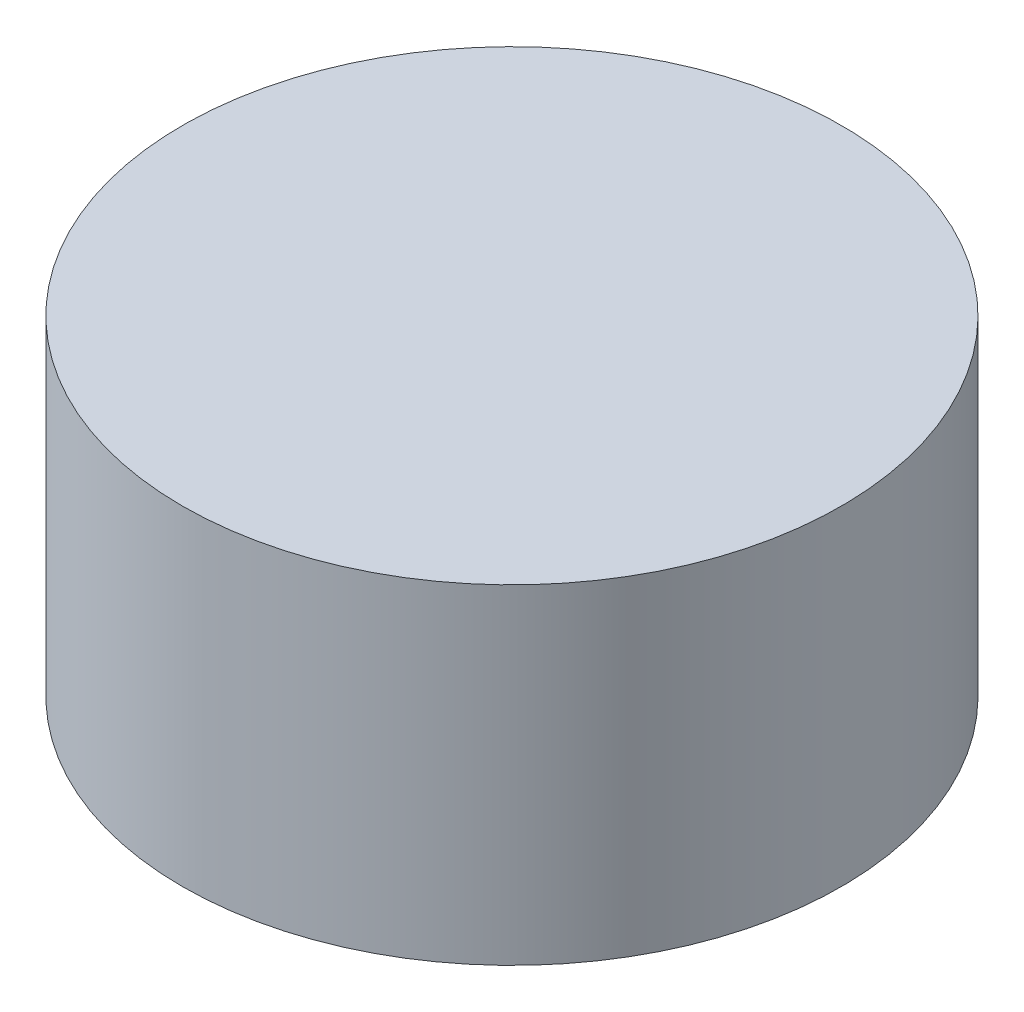
ISO-10303-21;
HEADER;
FILE_DESCRIPTION(('STEP AP214'),'2;1');
FILE_NAME('part.step','',(''),(''),'','','');
FILE_SCHEMA(('AUTOMOTIVE_DESIGN { 1 0 10303 214 1 1 1 1 }'));
ENDSEC;
DATA;
#1=APPLICATION_CONTEXT('core data for automotive mechanical design processes');
#2=APPLICATION_PROTOCOL_DEFINITION('international standard','automotive_design',2000,#1);
#3=PRODUCT_CONTEXT('',#1,'mechanical');
#4=PRODUCT('Part','Part','',(#3));
#5=PRODUCT_RELATED_PRODUCT_CATEGORY('part','',(#4));
#6=PRODUCT_DEFINITION_FORMATION('','',#4);
#7=PRODUCT_DEFINITION_CONTEXT('part definition',#1,'design');
#8=PRODUCT_DEFINITION('design','',#6,#7);
#9=PRODUCT_DEFINITION_SHAPE('','',#8);
#10=(LENGTH_UNIT() NAMED_UNIT(*) SI_UNIT(.MILLI.,.METRE.));
#11=(NAMED_UNIT(*) PLANE_ANGLE_UNIT() SI_UNIT($,.RADIAN.));
#12=(NAMED_UNIT(*) SI_UNIT($,.STERADIAN.) SOLID_ANGLE_UNIT());
#13=UNCERTAINTY_MEASURE_WITH_UNIT(LENGTH_MEASURE(1.E-05),#10,'distance_accuracy_value','');
#14=(GEOMETRIC_REPRESENTATION_CONTEXT(3) GLOBAL_UNCERTAINTY_ASSIGNED_CONTEXT((#13)) GLOBAL_UNIT_ASSIGNED_CONTEXT((#10,
#11,#12)) REPRESENTATION_CONTEXT('',''));
#15=CARTESIAN_POINT('',(0.,0.,0.));
#16=DIRECTION('',(0.,0.,1.));
#17=DIRECTION('',(1.,0.,0.));
#18=AXIS2_PLACEMENT_3D('',#15,#16,#17);
#19=CARTESIAN_POINT('',(0.,0.,0.));
#20=DIRECTION('',(0.,1.,0.));
#21=DIRECTION('',(0.,0.,1.));
#22=AXIS2_PLACEMENT_3D('',#19,#20,#21);
#23=PLANE('',#22);
#24=CARTESIAN_POINT('',(0.,0.,0.));
#25=DIRECTION('',(0.,1.,0.));
#26=DIRECTION('',(0.,0.,1.));
#27=AXIS2_PLACEMENT_3D('',#24,#25,#26);
#28=CIRCLE('',#27,6.);
#29=CARTESIAN_POINT('',(0.,0.,6.));
#30=VERTEX_POINT('',#29);
#31=EDGE_CURVE('E11',#30,#30,#28,.T.);
#32=ORIENTED_EDGE('',*,*,#31,.F.);
#33=EDGE_LOOP('',(#32));
#34=FACE_BOUND('',#33,.T.);
#35=CARTESIAN_POINT('',(0.,0.,0.));
#36=DIRECTION('',(0.,1.,0.));
#37=DIRECTION('',(0.,0.,1.));
#38=AXIS2_PLACEMENT_3D('',#35,#36,#37);
#39=CIRCLE('',#38,3.);
#40=CARTESIAN_POINT('',(0.,0.,3.));
#41=VERTEX_POINT('',#40);
#42=EDGE_CURVE('E44',#41,#41,#39,.T.);
#43=ORIENTED_EDGE('',*,*,#42,.T.);
#44=EDGE_LOOP('',(#43));
#45=FACE_BOUND('',#44,.T.);
#46=ADVANCED_FACE('F37',(#34,#45),#23,.F.);
#47=CARTESIAN_POINT('',(0.,3.,0.));
#48=DIRECTION('',(0.,-1.,0.));
#49=DIRECTION('',(0.,0.,-1.));
#50=AXIS2_PLACEMENT_3D('',#47,#48,#49);
#51=CYLINDRICAL_SURFACE('',#50,6.);
#52=ORIENTED_EDGE('',*,*,#31,.T.);
#53=EDGE_LOOP('',(#52));
#54=FACE_BOUND('',#53,.T.);
#55=CARTESIAN_POINT('',(0.,6.,0.));
#56=DIRECTION('',(0.,1.,0.));
#57=DIRECTION('',(0.,0.,1.));
#58=AXIS2_PLACEMENT_3D('',#55,#56,#57);
#59=CIRCLE('',#58,6.);
#60=CARTESIAN_POINT('',(0.,6.,6.));
#61=VERTEX_POINT('',#60);
#62=EDGE_CURVE('E52',#61,#61,#59,.T.);
#63=ORIENTED_EDGE('',*,*,#62,.F.);
#64=EDGE_LOOP('',(#63));
#65=FACE_BOUND('',#64,.T.);
#66=ADVANCED_FACE('F39',(#54,#65),#51,.T.);
#67=CARTESIAN_POINT('',(0.,3.,0.));
#68=DIRECTION('',(0.,-1.,0.));
#69=DIRECTION('',(0.,0.,-1.));
#70=AXIS2_PLACEMENT_3D('',#67,#68,#69);
#71=CYLINDRICAL_SURFACE('',#70,3.);
#72=CARTESIAN_POINT('',(0.,3.,0.));
#73=DIRECTION('',(0.,1.,0.));
#74=DIRECTION('',(0.,0.,1.));
#75=AXIS2_PLACEMENT_3D('',#72,#73,#74);
#76=CIRCLE('',#75,3.);
#77=CARTESIAN_POINT('',(0.,3.,3.));
#78=VERTEX_POINT('',#77);
#79=EDGE_CURVE('E48',#78,#78,#76,.T.);
#80=ORIENTED_EDGE('',*,*,#79,.T.);
#81=EDGE_LOOP('',(#80));
#82=FACE_BOUND('',#81,.T.);
#83=ORIENTED_EDGE('',*,*,#42,.F.);
#84=EDGE_LOOP('',(#83));
#85=FACE_BOUND('',#84,.T.);
#86=ADVANCED_FACE('F61',(#82,#85),#71,.F.);
#87=CARTESIAN_POINT('',(0.,3.,0.));
#88=DIRECTION('',(0.,1.,0.));
#89=DIRECTION('',(0.,0.,1.));
#90=AXIS2_PLACEMENT_3D('',#87,#88,#89);
#91=PLANE('',#90);
#92=ORIENTED_EDGE('',*,*,#79,.F.);
#93=EDGE_LOOP('',(#92));
#94=FACE_BOUND('',#93,.T.);
#95=ADVANCED_FACE('F66',(#94),#91,.F.);
#96=CARTESIAN_POINT('',(0.,6.,0.));
#97=DIRECTION('',(0.,1.,0.));
#98=DIRECTION('',(0.,0.,1.));
#99=AXIS2_PLACEMENT_3D('',#96,#97,#98);
#100=PLANE('',#99);
#101=ORIENTED_EDGE('',*,*,#62,.T.);
#102=EDGE_LOOP('',(#101));
#103=FACE_BOUND('',#102,.T.);
#104=ADVANCED_FACE('F58',(#103),#100,.T.);
#105=CLOSED_SHELL('',(#46,#66,#86,#95,#104));
#106=MANIFOLD_SOLID_BREP('B2',#105);
#107=ADVANCED_BREP_SHAPE_REPRESENTATION('',(#18,#106),#14);
#108=SHAPE_DEFINITION_REPRESENTATION(#9,#107);
ENDSEC;
END-ISO-10303-21;
